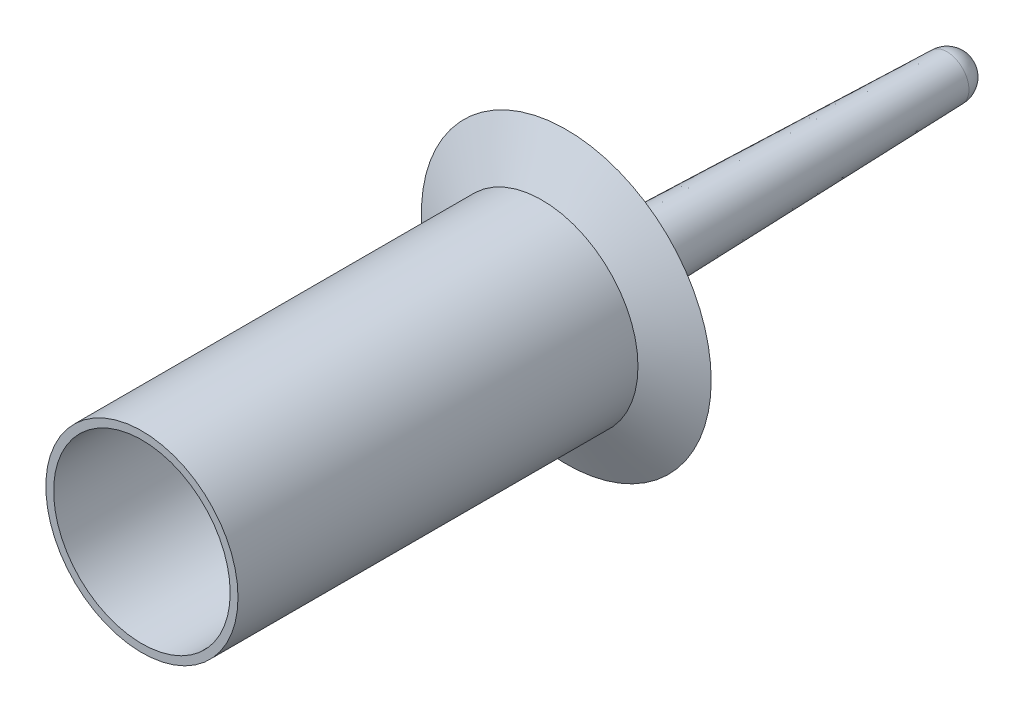
ISO-10303-21;
HEADER;
FILE_DESCRIPTION(('STEP AP214'),'2;1');
FILE_NAME('part.step','',(''),(''),'','','');
FILE_SCHEMA(('AUTOMOTIVE_DESIGN { 1 0 10303 214 1 1 1 1 }'));
ENDSEC;
DATA;
#1=APPLICATION_CONTEXT('core data for automotive mechanical design processes');
#2=APPLICATION_PROTOCOL_DEFINITION('international standard','automotive_design',2000,#1);
#3=PRODUCT_CONTEXT('',#1,'mechanical');
#4=PRODUCT('Part','Part','',(#3));
#5=PRODUCT_RELATED_PRODUCT_CATEGORY('part','',(#4));
#6=PRODUCT_DEFINITION_FORMATION('','',#4);
#7=PRODUCT_DEFINITION_CONTEXT('part definition',#1,'design');
#8=PRODUCT_DEFINITION('design','',#6,#7);
#9=PRODUCT_DEFINITION_SHAPE('','',#8);
#10=(LENGTH_UNIT() NAMED_UNIT(*) SI_UNIT(.MILLI.,.METRE.));
#11=(NAMED_UNIT(*) PLANE_ANGLE_UNIT() SI_UNIT($,.RADIAN.));
#12=(NAMED_UNIT(*) SI_UNIT($,.STERADIAN.) SOLID_ANGLE_UNIT());
#13=UNCERTAINTY_MEASURE_WITH_UNIT(LENGTH_MEASURE(1.E-05),#10,'distance_accuracy_value','');
#14=(GEOMETRIC_REPRESENTATION_CONTEXT(3) GLOBAL_UNCERTAINTY_ASSIGNED_CONTEXT((#13)) GLOBAL_UNIT_ASSIGNED_CONTEXT((#10,
#11,#12)) REPRESENTATION_CONTEXT('',''));
#15=CARTESIAN_POINT('',(0.,0.,0.));
#16=DIRECTION('',(0.,0.,1.));
#17=DIRECTION('',(1.,0.,0.));
#18=AXIS2_PLACEMENT_3D('',#15,#16,#17);
#19=CARTESIAN_POINT('',(0.,0.,-64.4906));
#20=DIRECTION('',(0.,0.,1.));
#21=DIRECTION('',(1.,0.,0.));
#22=AXIS2_PLACEMENT_3D('',#19,#20,#21);
#23=CONICAL_SURFACE('',#22,8.4963,0.0299091111469074);
#24=CARTESIAN_POINT('',(0.,0.,-157.4546));
#25=DIRECTION('',(0.,0.,1.));
#26=DIRECTION('',(1.,0.,0.));
#27=AXIS2_PLACEMENT_3D('',#24,#25,#26);
#28=CIRCLE('',#27,5.715);
#29=CARTESIAN_POINT('',(5.715,0.,-157.4546));
#30=VERTEX_POINT('',#29);
#31=EDGE_CURVE('E10',#30,#30,#28,.T.);
#32=ORIENTED_EDGE('',*,*,#31,.T.);
#33=EDGE_LOOP('',(#32));
#34=FACE_BOUND('',#33,.T.);
#35=CARTESIAN_POINT('',(0.,0.,-64.4906));
#36=DIRECTION('',(0.,0.,1.));
#37=DIRECTION('',(1.,0.,0.));
#38=AXIS2_PLACEMENT_3D('',#35,#36,#37);
#39=CIRCLE('',#38,8.4963);
#40=CARTESIAN_POINT('',(8.4963,0.,-64.4906));
#41=VERTEX_POINT('',#40);
#42=EDGE_CURVE('E63',#41,#41,#39,.T.);
#43=ORIENTED_EDGE('',*,*,#42,.F.);
#44=EDGE_LOOP('',(#43));
#45=FACE_BOUND('',#44,.T.);
#46=ADVANCED_FACE('F35',(#34,#45),#23,.T.);
#47=CARTESIAN_POINT('',(0.,0.,-157.4546));
#48=DIRECTION('',(0.,0.,1.));
#49=DIRECTION('',(1.,0.,0.));
#50=AXIS2_PLACEMENT_3D('',#47,#48,#49);
#51=SPHERICAL_SURFACE('',#50,5.715);
#52=ORIENTED_EDGE('',*,*,#31,.F.);
#53=EDGE_LOOP('',(#52));
#54=FACE_BOUND('',#53,.T.);
#55=ADVANCED_FACE('F71',(#54),#51,.T.);
#56=CARTESIAN_POINT('',(0.,0.,-52.0446));
#57=DIRECTION('',(0.,0.,-1.));
#58=DIRECTION('',(-1.,0.,0.));
#59=AXIS2_PLACEMENT_3D('',#56,#57,#58);
#60=PLANE('',#59);
#61=CARTESIAN_POINT('',(0.,0.,-52.0446));
#62=DIRECTION('',(0.,0.,1.));
#63=DIRECTION('',(1.,0.,0.));
#64=AXIS2_PLACEMENT_3D('',#61,#62,#63);
#65=CIRCLE('',#64,22.9743);
#66=CARTESIAN_POINT('',(22.9743,0.,-52.0446));
#67=VERTEX_POINT('',#66);
#68=EDGE_CURVE('E41',#67,#67,#65,.T.);
#69=ORIENTED_EDGE('',*,*,#68,.T.);
#70=EDGE_LOOP('',(#69));
#71=FACE_BOUND('',#70,.T.);
#72=ADVANCED_FACE('F75',(#71),#60,.F.);
#73=CARTESIAN_POINT('',(0.,0.,52.0446));
#74=DIRECTION('',(0.,0.,1.));
#75=DIRECTION('',(1.,0.,0.));
#76=AXIS2_PLACEMENT_3D('',#73,#74,#75);
#77=CYLINDRICAL_SURFACE('',#76,22.9743);
#78=CARTESIAN_POINT('',(0.,0.,52.0446));
#79=DIRECTION('',(0.,0.,1.));
#80=DIRECTION('',(1.,0.,0.));
#81=AXIS2_PLACEMENT_3D('',#78,#79,#80);
#82=CIRCLE('',#81,22.9743);
#83=CARTESIAN_POINT('',(22.9743,0.,52.0446));
#84=VERTEX_POINT('',#83);
#85=EDGE_CURVE('E45',#84,#84,#82,.T.);
#86=ORIENTED_EDGE('',*,*,#85,.T.);
#87=EDGE_LOOP('',(#86));
#88=FACE_BOUND('',#87,.T.);
#89=ORIENTED_EDGE('',*,*,#68,.F.);
#90=EDGE_LOOP('',(#89));
#91=FACE_BOUND('',#90,.T.);
#92=ADVANCED_FACE('F80',(#88,#91),#77,.F.);
#93=CARTESIAN_POINT('',(0.,0.,52.0446));
#94=DIRECTION('',(0.,0.,1.));
#95=DIRECTION('',(1.,0.,0.));
#96=AXIS2_PLACEMENT_3D('',#93,#94,#95);
#97=PLANE('',#96);
#98=CARTESIAN_POINT('',(0.,0.,52.0446));
#99=DIRECTION('',(0.,0.,1.));
#100=DIRECTION('',(1.,0.,0.));
#101=AXIS2_PLACEMENT_3D('',#98,#99,#100);
#102=CIRCLE('',#101,25.0063);
#103=CARTESIAN_POINT('',(25.0063,0.,52.0446));
#104=VERTEX_POINT('',#103);
#105=EDGE_CURVE('E49',#104,#104,#102,.T.);
#106=ORIENTED_EDGE('',*,*,#105,.T.);
#107=EDGE_LOOP('',(#106));
#108=FACE_BOUND('',#107,.T.);
#109=ORIENTED_EDGE('',*,*,#85,.F.);
#110=EDGE_LOOP('',(#109));
#111=FACE_BOUND('',#110,.T.);
#112=ADVANCED_FACE('F85',(#108,#111),#97,.T.);
#113=CARTESIAN_POINT('',(0.,0.,52.0446));
#114=DIRECTION('',(0.,0.,1.));
#115=DIRECTION('',(1.,0.,0.));
#116=AXIS2_PLACEMENT_3D('',#113,#114,#115);
#117=CYLINDRICAL_SURFACE('',#116,25.0063);
#118=ORIENTED_EDGE('',*,*,#105,.F.);
#119=EDGE_LOOP('',(#118));
#120=FACE_BOUND('',#119,.T.);
#121=CARTESIAN_POINT('',(0.,0.,-52.0446));
#122=DIRECTION('',(0.,0.,1.));
#123=DIRECTION('',(1.,0.,0.));
#124=AXIS2_PLACEMENT_3D('',#121,#122,#123);
#125=CIRCLE('',#124,25.0063);
#126=CARTESIAN_POINT('',(25.0063,0.,-52.0446));
#127=VERTEX_POINT('',#126);
#128=EDGE_CURVE('E54',#127,#127,#125,.T.);
#129=ORIENTED_EDGE('',*,*,#128,.T.);
#130=EDGE_LOOP('',(#129));
#131=FACE_BOUND('',#130,.T.);
#132=ADVANCED_FACE('F89',(#120,#131),#117,.T.);
#133=CARTESIAN_POINT('',(0.,0.,-52.0446));
#134=DIRECTION('',(0.,0.,-1.));
#135=DIRECTION('',(-1.,0.,0.));
#136=AXIS2_PLACEMENT_3D('',#133,#134,#135);
#137=CONICAL_SURFACE('',#136,25.0063,1.10714871779409);
#138=CARTESIAN_POINT('',(0.,0.,-58.3946));
#139=DIRECTION('',(0.,0.,1.));
#140=DIRECTION('',(1.,0.,0.));
#141=AXIS2_PLACEMENT_3D('',#138,#139,#140);
#142=CIRCLE('',#141,37.7063);
#143=CARTESIAN_POINT('',(37.7063,0.,-58.3946));
#144=VERTEX_POINT('',#143);
#145=EDGE_CURVE('E57',#144,#144,#142,.T.);
#146=ORIENTED_EDGE('',*,*,#145,.T.);
#147=EDGE_LOOP('',(#146));
#148=FACE_BOUND('',#147,.T.);
#149=ORIENTED_EDGE('',*,*,#128,.F.);
#150=EDGE_LOOP('',(#149));
#151=FACE_BOUND('',#150,.T.);
#152=ADVANCED_FACE('F93',(#148,#151),#137,.T.);
#153=CARTESIAN_POINT('',(0.,0.,-58.3946));
#154=DIRECTION('',(0.,0.,-1.));
#155=DIRECTION('',(-1.,0.,0.));
#156=AXIS2_PLACEMENT_3D('',#153,#154,#155);
#157=CONICAL_SURFACE('',#156,37.7063,1.56799132654586);
#158=CARTESIAN_POINT('',(0.,0.,-58.3305195219457));
#159=DIRECTION('',(0.,0.,1.));
#160=DIRECTION('',(1.,0.,0.));
#161=AXIS2_PLACEMENT_3D('',#158,#159,#160);
#162=CIRCLE('',#161,14.8612717280435);
#163=CARTESIAN_POINT('',(14.8612717280435,0.,-58.3305195219457));
#164=VERTEX_POINT('',#163);
#165=EDGE_CURVE('E60',#164,#164,#162,.T.);
#166=ORIENTED_EDGE('',*,*,#165,.T.);
#167=EDGE_LOOP('',(#166));
#168=FACE_BOUND('',#167,.T.);
#169=ORIENTED_EDGE('',*,*,#145,.F.);
#170=EDGE_LOOP('',(#169));
#171=FACE_BOUND('',#170,.T.);
#172=ADVANCED_FACE('F97',(#168,#171),#157,.F.);
#173=CARTESIAN_POINT('',(0.,0.,-64.6804945409782));
#174=DIRECTION('',(0.,0.,1.));
#175=DIRECTION('',(1.,0.,0.));
#176=AXIS2_PLACEMENT_3D('',#173,#174,#175);
#177=TOROIDAL_SURFACE('',#176,14.8434599998193,6.34999999999999);
#178=ORIENTED_EDGE('',*,*,#42,.T.);
#179=EDGE_LOOP('',(#178));
#180=FACE_BOUND('',#179,.T.);
#181=ORIENTED_EDGE('',*,*,#165,.F.);
#182=EDGE_LOOP('',(#181));
#183=FACE_BOUND('',#182,.T.);
#184=ADVANCED_FACE('F67',(#180,#183),#177,.F.);
#185=CLOSED_SHELL('',(#46,#55,#72,#92,#112,#132,#152,#172,#184));
#186=MANIFOLD_SOLID_BREP('B2',#185);
#187=ADVANCED_BREP_SHAPE_REPRESENTATION('',(#18,#186),#14);
#188=SHAPE_DEFINITION_REPRESENTATION(#9,#187);
ENDSEC;
END-ISO-10303-21;
